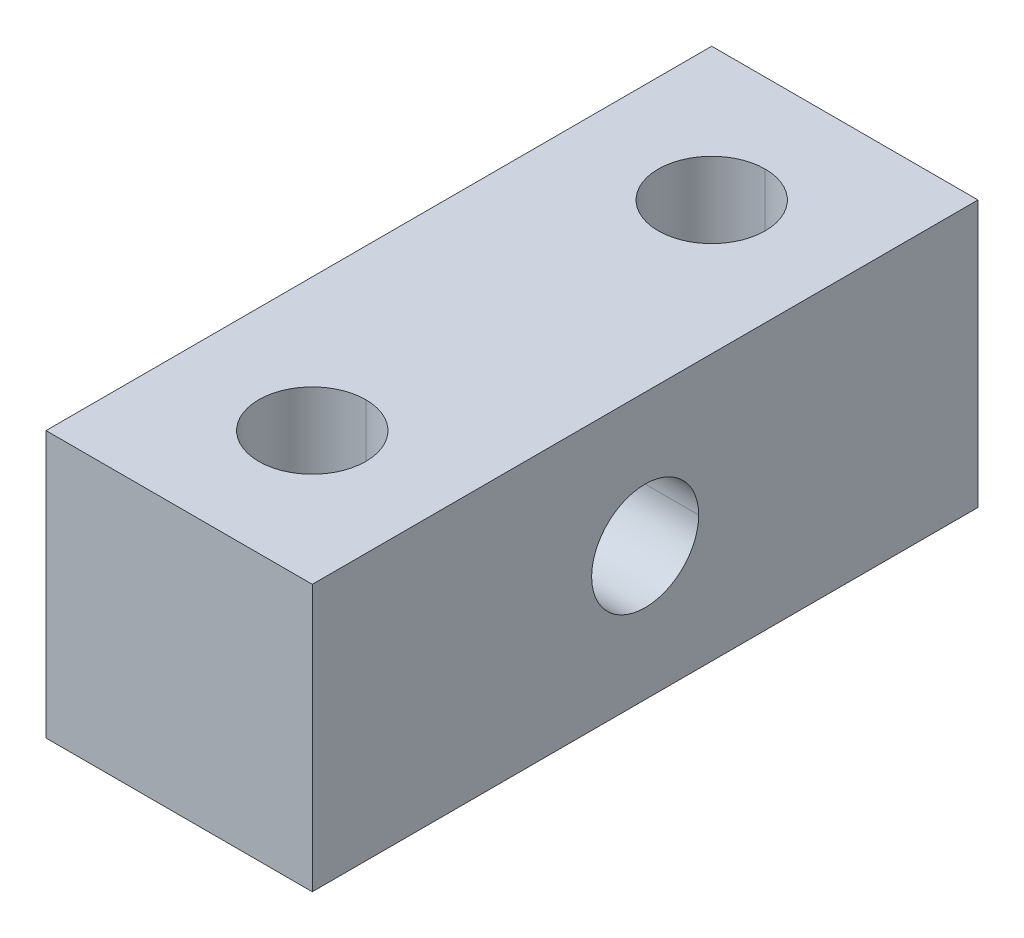
ISO-10303-21;
HEADER;
FILE_DESCRIPTION(('STEP AP214'),'2;1');
FILE_NAME('part.step','',(''),(''),'','','');
FILE_SCHEMA(('AUTOMOTIVE_DESIGN { 1 0 10303 214 1 1 1 1 }'));
ENDSEC;
DATA;
#1=APPLICATION_CONTEXT('core data for automotive mechanical design processes');
#2=APPLICATION_PROTOCOL_DEFINITION('international standard','automotive_design',2000,#1);
#3=PRODUCT_CONTEXT('',#1,'mechanical');
#4=PRODUCT('Part','Part','',(#3));
#5=PRODUCT_RELATED_PRODUCT_CATEGORY('part','',(#4));
#6=PRODUCT_DEFINITION_FORMATION('','',#4);
#7=PRODUCT_DEFINITION_CONTEXT('part definition',#1,'design');
#8=PRODUCT_DEFINITION('design','',#6,#7);
#9=PRODUCT_DEFINITION_SHAPE('','',#8);
#10=(LENGTH_UNIT() NAMED_UNIT(*) SI_UNIT(.MILLI.,.METRE.));
#11=(NAMED_UNIT(*) PLANE_ANGLE_UNIT() SI_UNIT($,.RADIAN.));
#12=(NAMED_UNIT(*) SI_UNIT($,.STERADIAN.) SOLID_ANGLE_UNIT());
#13=UNCERTAINTY_MEASURE_WITH_UNIT(LENGTH_MEASURE(1.E-05),#10,'distance_accuracy_value','');
#14=(GEOMETRIC_REPRESENTATION_CONTEXT(3) GLOBAL_UNCERTAINTY_ASSIGNED_CONTEXT((#13)) GLOBAL_UNIT_ASSIGNED_CONTEXT((#10,
#11,#12)) REPRESENTATION_CONTEXT('',''));
#15=CARTESIAN_POINT('',(0.,0.,0.));
#16=DIRECTION('',(0.,0.,1.));
#17=DIRECTION('',(1.,0.,0.));
#18=AXIS2_PLACEMENT_3D('',#15,#16,#17);
#19=CARTESIAN_POINT('',(6.35,0.,-15.875));
#20=DIRECTION('',(1.,0.,0.));
#21=DIRECTION('',(0.,0.,-1.));
#22=AXIS2_PLACEMENT_3D('',#19,#20,#21);
#23=CYLINDRICAL_SURFACE('',#22,2.5527);
#24=DIRECTION('',(1.,0.,0.));
#25=VECTOR('',#24,1.);
#26=CARTESIAN_POINT('',(6.35,0.,-13.3223));
#27=LINE('',#26,#25);
#28=CARTESIAN_POINT('',(-6.35,0.,-13.3223));
#29=VERTEX_POINT('',#28);
#30=CARTESIAN_POINT('',(6.35,0.,-13.3223));
#31=VERTEX_POINT('',#30);
#32=EDGE_CURVE('E153',#29,#31,#27,.T.);
#33=ORIENTED_EDGE('',*,*,#32,.F.);
#34=CARTESIAN_POINT('',(-6.35,0.,-15.875));
#35=DIRECTION('',(1.,0.,0.));
#36=DIRECTION('',(0.,0.,-1.));
#37=AXIS2_PLACEMENT_3D('',#34,#35,#36);
#38=CIRCLE('',#37,2.5527);
#39=CARTESIAN_POINT('',(-6.35,0.,-18.4277));
#40=VERTEX_POINT('',#39);
#41=EDGE_CURVE('E115',#40,#29,#38,.T.);
#42=ORIENTED_EDGE('',*,*,#41,.F.);
#43=DIRECTION('',(1.,0.,0.));
#44=VECTOR('',#43,1.);
#45=CARTESIAN_POINT('',(6.35,0.,-18.4277));
#46=LINE('',#45,#44);
#47=CARTESIAN_POINT('',(6.35,0.,-18.4277));
#48=VERTEX_POINT('',#47);
#49=EDGE_CURVE('E178',#40,#48,#46,.T.);
#50=ORIENTED_EDGE('',*,*,#49,.T.);
#51=CARTESIAN_POINT('',(6.35,0.,-15.875));
#52=DIRECTION('',(1.,0.,0.));
#53=DIRECTION('',(0.,0.,-1.));
#54=AXIS2_PLACEMENT_3D('',#51,#52,#53);
#55=CIRCLE('',#54,2.5527);
#56=EDGE_CURVE('E161',#48,#31,#55,.T.);
#57=ORIENTED_EDGE('',*,*,#56,.T.);
#58=EDGE_LOOP('',(#33,#42,#50,#57));
#59=FACE_BOUND('',#58,.T.);
#60=ADVANCED_FACE('F15',(#59),#23,.F.);
#61=CARTESIAN_POINT('',(0.,6.35,-6.35));
#62=DIRECTION('',(0.,1.,0.));
#63=DIRECTION('',(0.,0.,1.));
#64=AXIS2_PLACEMENT_3D('',#61,#62,#63);
#65=CYLINDRICAL_SURFACE('',#64,2.5527);
#66=DIRECTION('',(0.,1.,0.));
#67=VECTOR('',#66,1.);
#68=CARTESIAN_POINT('',(0.,6.35,-8.9027));
#69=LINE('',#68,#67);
#70=CARTESIAN_POINT('',(0.,-6.35,-8.9027));
#71=VERTEX_POINT('',#70);
#72=CARTESIAN_POINT('',(0.,6.35,-8.9027));
#73=VERTEX_POINT('',#72);
#74=EDGE_CURVE('E162',#71,#73,#69,.T.);
#75=ORIENTED_EDGE('',*,*,#74,.F.);
#76=CARTESIAN_POINT('',(0.,-6.35,-6.35));
#77=DIRECTION('',(0.,1.,0.));
#78=DIRECTION('',(0.,0.,1.));
#79=AXIS2_PLACEMENT_3D('',#76,#77,#78);
#80=CIRCLE('',#79,2.5527);
#81=CARTESIAN_POINT('',(0.,-6.35,-3.7973));
#82=VERTEX_POINT('',#81);
#83=EDGE_CURVE('E26',#82,#71,#80,.T.);
#84=ORIENTED_EDGE('',*,*,#83,.F.);
#85=DIRECTION('',(0.,1.,0.));
#86=VECTOR('',#85,1.);
#87=CARTESIAN_POINT('',(0.,6.35,-3.7973));
#88=LINE('',#87,#86);
#89=CARTESIAN_POINT('',(0.,6.35,-3.7973));
#90=VERTEX_POINT('',#89);
#91=EDGE_CURVE('E187',#82,#90,#88,.T.);
#92=ORIENTED_EDGE('',*,*,#91,.T.);
#93=CARTESIAN_POINT('',(0.,6.35,-6.35));
#94=DIRECTION('',(0.,1.,0.));
#95=DIRECTION('',(0.,0.,1.));
#96=AXIS2_PLACEMENT_3D('',#93,#94,#95);
#97=CIRCLE('',#96,2.5527);
#98=EDGE_CURVE('E201',#90,#73,#97,.T.);
#99=ORIENTED_EDGE('',*,*,#98,.T.);
#100=EDGE_LOOP('',(#75,#84,#92,#99));
#101=FACE_BOUND('',#100,.T.);
#102=ADVANCED_FACE('F223',(#101),#65,.F.);
#103=CARTESIAN_POINT('',(0.,6.35,-25.4));
#104=DIRECTION('',(0.,1.,0.));
#105=DIRECTION('',(0.,0.,1.));
#106=AXIS2_PLACEMENT_3D('',#103,#104,#105);
#107=CYLINDRICAL_SURFACE('',#106,2.5527);
#108=DIRECTION('',(0.,1.,0.));
#109=VECTOR('',#108,1.);
#110=CARTESIAN_POINT('',(0.,6.35,-27.9527));
#111=LINE('',#110,#109);
#112=CARTESIAN_POINT('',(0.,-6.35,-27.9527));
#113=VERTEX_POINT('',#112);
#114=CARTESIAN_POINT('',(0.,6.35,-27.9527));
#115=VERTEX_POINT('',#114);
#116=EDGE_CURVE('E19',#113,#115,#111,.T.);
#117=ORIENTED_EDGE('',*,*,#116,.F.);
#118=CARTESIAN_POINT('',(0.,-6.35,-25.4));
#119=DIRECTION('',(0.,1.,0.));
#120=DIRECTION('',(0.,0.,1.));
#121=AXIS2_PLACEMENT_3D('',#118,#119,#120);
#122=CIRCLE('',#121,2.5527);
#123=CARTESIAN_POINT('',(0.,-6.35,-22.8473));
#124=VERTEX_POINT('',#123);
#125=EDGE_CURVE('E10',#124,#113,#122,.T.);
#126=ORIENTED_EDGE('',*,*,#125,.F.);
#127=DIRECTION('',(0.,1.,0.));
#128=VECTOR('',#127,1.);
#129=CARTESIAN_POINT('',(0.,6.35,-22.8473));
#130=LINE('',#129,#128);
#131=CARTESIAN_POINT('',(0.,6.35,-22.8473));
#132=VERTEX_POINT('',#131);
#133=EDGE_CURVE('E132',#124,#132,#130,.T.);
#134=ORIENTED_EDGE('',*,*,#133,.T.);
#135=CARTESIAN_POINT('',(0.,6.35,-25.4));
#136=DIRECTION('',(0.,1.,0.));
#137=DIRECTION('',(0.,0.,1.));
#138=AXIS2_PLACEMENT_3D('',#135,#136,#137);
#139=CIRCLE('',#138,2.5527);
#140=EDGE_CURVE('E148',#132,#115,#139,.T.);
#141=ORIENTED_EDGE('',*,*,#140,.T.);
#142=EDGE_LOOP('',(#117,#126,#134,#141));
#143=FACE_BOUND('',#142,.T.);
#144=ADVANCED_FACE('F252',(#143),#107,.F.);
#145=CARTESIAN_POINT('',(-6.35,6.35,0.));
#146=DIRECTION('',(0.,0.,1.));
#147=DIRECTION('',(1.,0.,0.));
#148=AXIS2_PLACEMENT_3D('',#145,#146,#147);
#149=PLANE('',#148);
#150=DIRECTION('',(0.,-1.,0.));
#151=VECTOR('',#150,1.);
#152=CARTESIAN_POINT('',(-6.35,-6.35,0.));
#153=LINE('',#152,#151);
#154=CARTESIAN_POINT('',(-6.35,6.35,0.));
#155=VERTEX_POINT('',#154);
#156=CARTESIAN_POINT('',(-6.35,-6.35,0.));
#157=VERTEX_POINT('',#156);
#158=EDGE_CURVE('E107',#155,#157,#153,.T.);
#159=ORIENTED_EDGE('',*,*,#158,.T.);
#160=DIRECTION('',(1.,0.,0.));
#161=VECTOR('',#160,1.);
#162=CARTESIAN_POINT('',(6.35,-6.35,0.));
#163=LINE('',#162,#161);
#164=CARTESIAN_POINT('',(6.35,-6.35,0.));
#165=VERTEX_POINT('',#164);
#166=EDGE_CURVE('E156',#157,#165,#163,.T.);
#167=ORIENTED_EDGE('',*,*,#166,.T.);
#168=DIRECTION('',(0.,1.,0.));
#169=VECTOR('',#168,1.);
#170=CARTESIAN_POINT('',(6.35,-6.35,0.));
#171=LINE('',#170,#169);
#172=CARTESIAN_POINT('',(6.35,6.35,0.));
#173=VERTEX_POINT('',#172);
#174=EDGE_CURVE('E109',#165,#173,#171,.T.);
#175=ORIENTED_EDGE('',*,*,#174,.T.);
#176=DIRECTION('',(-1.,0.,0.));
#177=VECTOR('',#176,1.);
#178=CARTESIAN_POINT('',(6.35,6.35,0.));
#179=LINE('',#178,#177);
#180=EDGE_CURVE('E103',#173,#155,#179,.T.);
#181=ORIENTED_EDGE('',*,*,#180,.T.);
#182=EDGE_LOOP('',(#159,#167,#175,#181));
#183=FACE_BOUND('',#182,.T.);
#184=ADVANCED_FACE('F105',(#183),#149,.T.);
#185=CARTESIAN_POINT('',(-6.35,6.35,-31.75));
#186=DIRECTION('',(0.,0.,1.));
#187=DIRECTION('',(1.,0.,0.));
#188=AXIS2_PLACEMENT_3D('',#185,#186,#187);
#189=PLANE('',#188);
#190=DIRECTION('',(0.,-1.,0.));
#191=VECTOR('',#190,1.);
#192=CARTESIAN_POINT('',(-6.35,-6.35,-31.75));
#193=LINE('',#192,#191);
#194=CARTESIAN_POINT('',(-6.35,6.35,-31.75));
#195=VERTEX_POINT('',#194);
#196=CARTESIAN_POINT('',(-6.35,-6.35,-31.75));
#197=VERTEX_POINT('',#196);
#198=EDGE_CURVE('E127',#195,#197,#193,.T.);
#199=ORIENTED_EDGE('',*,*,#198,.F.);
#200=DIRECTION('',(-1.,0.,0.));
#201=VECTOR('',#200,1.);
#202=CARTESIAN_POINT('',(6.35,6.35,-31.75));
#203=LINE('',#202,#201);
#204=CARTESIAN_POINT('',(6.35,6.35,-31.75));
#205=VERTEX_POINT('',#204);
#206=EDGE_CURVE('E122',#205,#195,#203,.T.);
#207=ORIENTED_EDGE('',*,*,#206,.F.);
#208=DIRECTION('',(0.,1.,0.));
#209=VECTOR('',#208,1.);
#210=CARTESIAN_POINT('',(6.35,-6.35,-31.75));
#211=LINE('',#210,#209);
#212=CARTESIAN_POINT('',(6.35,-6.35,-31.75));
#213=VERTEX_POINT('',#212);
#214=EDGE_CURVE('E168',#213,#205,#211,.T.);
#215=ORIENTED_EDGE('',*,*,#214,.F.);
#216=DIRECTION('',(1.,0.,0.));
#217=VECTOR('',#216,1.);
#218=CARTESIAN_POINT('',(6.35,-6.35,-31.75));
#219=LINE('',#218,#217);
#220=EDGE_CURVE('E41',#197,#213,#219,.T.);
#221=ORIENTED_EDGE('',*,*,#220,.F.);
#222=EDGE_LOOP('',(#199,#207,#215,#221));
#223=FACE_BOUND('',#222,.T.);
#224=ADVANCED_FACE('F270',(#223),#189,.F.);
#225=CARTESIAN_POINT('',(6.35,-6.35,-31.75));
#226=DIRECTION('',(0.,-1.,0.));
#227=DIRECTION('',(0.,0.,-1.));
#228=AXIS2_PLACEMENT_3D('',#225,#226,#227);
#229=PLANE('',#228);
#230=ORIENTED_EDGE('',*,*,#125,.T.);
#231=CARTESIAN_POINT('',(0.,-6.35,-25.4));
#232=DIRECTION('',(0.,1.,0.));
#233=DIRECTION('',(0.,0.,1.));
#234=AXIS2_PLACEMENT_3D('',#231,#232,#233);
#235=CIRCLE('',#234,2.5527);
#236=EDGE_CURVE('E188',#113,#124,#235,.T.);
#237=ORIENTED_EDGE('',*,*,#236,.T.);
#238=EDGE_LOOP('',(#230,#237));
#239=FACE_BOUND('',#238,.T.);
#240=ORIENTED_EDGE('',*,*,#83,.T.);
#241=CARTESIAN_POINT('',(0.,-6.35,-6.35));
#242=DIRECTION('',(0.,1.,0.));
#243=DIRECTION('',(0.,0.,1.));
#244=AXIS2_PLACEMENT_3D('',#241,#242,#243);
#245=CIRCLE('',#244,2.5527);
#246=EDGE_CURVE('E143',#71,#82,#245,.T.);
#247=ORIENTED_EDGE('',*,*,#246,.T.);
#248=EDGE_LOOP('',(#240,#247));
#249=FACE_BOUND('',#248,.T.);
#250=ORIENTED_EDGE('',*,*,#166,.F.);
#251=DIRECTION('',(0.,0.,1.));
#252=VECTOR('',#251,1.);
#253=CARTESIAN_POINT('',(-6.35,-6.35,-31.75));
#254=LINE('',#253,#252);
#255=EDGE_CURVE('E130',#197,#157,#254,.T.);
#256=ORIENTED_EDGE('',*,*,#255,.F.);
#257=ORIENTED_EDGE('',*,*,#220,.T.);
#258=DIRECTION('',(0.,0.,1.));
#259=VECTOR('',#258,1.);
#260=CARTESIAN_POINT('',(6.35,-6.35,-31.75));
#261=LINE('',#260,#259);
#262=EDGE_CURVE('E147',#213,#165,#261,.T.);
#263=ORIENTED_EDGE('',*,*,#262,.T.);
#264=EDGE_LOOP('',(#250,#256,#257,#263));
#265=FACE_BOUND('',#264,.T.);
#266=ADVANCED_FACE('F242',(#239,#249,#265),#229,.T.);
#267=CARTESIAN_POINT('',(6.35,-6.35,-31.75));
#268=DIRECTION('',(1.,0.,0.));
#269=DIRECTION('',(0.,1.,0.));
#270=AXIS2_PLACEMENT_3D('',#267,#268,#269);
#271=PLANE('',#270);
#272=ORIENTED_EDGE('',*,*,#56,.F.);
#273=CARTESIAN_POINT('',(6.35,0.,-15.875));
#274=DIRECTION('',(1.,0.,0.));
#275=DIRECTION('',(0.,0.,-1.));
#276=AXIS2_PLACEMENT_3D('',#273,#274,#275);
#277=CIRCLE('',#276,2.5527);
#278=EDGE_CURVE('E174',#31,#48,#277,.T.);
#279=ORIENTED_EDGE('',*,*,#278,.F.);
#280=EDGE_LOOP('',(#272,#279));
#281=FACE_BOUND('',#280,.T.);
#282=ORIENTED_EDGE('',*,*,#174,.F.);
#283=ORIENTED_EDGE('',*,*,#262,.F.);
#284=ORIENTED_EDGE('',*,*,#214,.T.);
#285=DIRECTION('',(0.,0.,1.));
#286=VECTOR('',#285,1.);
#287=CARTESIAN_POINT('',(6.35,6.35,-31.75));
#288=LINE('',#287,#286);
#289=EDGE_CURVE('E114',#205,#173,#288,.T.);
#290=ORIENTED_EDGE('',*,*,#289,.T.);
#291=EDGE_LOOP('',(#282,#283,#284,#290));
#292=FACE_BOUND('',#291,.T.);
#293=ADVANCED_FACE('F232',(#281,#292),#271,.T.);
#294=CARTESIAN_POINT('',(6.35,6.35,-31.75));
#295=DIRECTION('',(0.,1.,0.));
#296=DIRECTION('',(1.,0.,0.));
#297=AXIS2_PLACEMENT_3D('',#294,#295,#296);
#298=PLANE('',#297);
#299=ORIENTED_EDGE('',*,*,#140,.F.);
#300=CARTESIAN_POINT('',(0.,6.35,-25.4));
#301=DIRECTION('',(0.,1.,0.));
#302=DIRECTION('',(0.,0.,1.));
#303=AXIS2_PLACEMENT_3D('',#300,#301,#302);
#304=CIRCLE('',#303,2.5527);
#305=EDGE_CURVE('E139',#115,#132,#304,.T.);
#306=ORIENTED_EDGE('',*,*,#305,.F.);
#307=EDGE_LOOP('',(#299,#306));
#308=FACE_BOUND('',#307,.T.);
#309=ORIENTED_EDGE('',*,*,#98,.F.);
#310=CARTESIAN_POINT('',(0.,6.35,-6.35));
#311=DIRECTION('',(0.,1.,0.));
#312=DIRECTION('',(0.,0.,1.));
#313=AXIS2_PLACEMENT_3D('',#310,#311,#312);
#314=CIRCLE('',#313,2.5527);
#315=EDGE_CURVE('E166',#73,#90,#314,.T.);
#316=ORIENTED_EDGE('',*,*,#315,.F.);
#317=EDGE_LOOP('',(#309,#316));
#318=FACE_BOUND('',#317,.T.);
#319=ORIENTED_EDGE('',*,*,#180,.F.);
#320=ORIENTED_EDGE('',*,*,#289,.F.);
#321=ORIENTED_EDGE('',*,*,#206,.T.);
#322=DIRECTION('',(0.,0.,1.));
#323=VECTOR('',#322,1.);
#324=CARTESIAN_POINT('',(-6.35,6.35,-31.75));
#325=LINE('',#324,#323);
#326=EDGE_CURVE('E119',#195,#155,#325,.T.);
#327=ORIENTED_EDGE('',*,*,#326,.T.);
#328=EDGE_LOOP('',(#319,#320,#321,#327));
#329=FACE_BOUND('',#328,.T.);
#330=ADVANCED_FACE('F120',(#308,#318,#329),#298,.T.);
#331=CARTESIAN_POINT('',(-6.35,-6.35,-31.75));
#332=DIRECTION('',(-1.,0.,0.));
#333=DIRECTION('',(0.,0.,1.));
#334=AXIS2_PLACEMENT_3D('',#331,#332,#333);
#335=PLANE('',#334);
#336=ORIENTED_EDGE('',*,*,#41,.T.);
#337=CARTESIAN_POINT('',(-6.35,0.,-15.875));
#338=DIRECTION('',(1.,0.,0.));
#339=DIRECTION('',(0.,0.,-1.));
#340=AXIS2_PLACEMENT_3D('',#337,#338,#339);
#341=CIRCLE('',#340,2.5527);
#342=EDGE_CURVE('E149',#29,#40,#341,.T.);
#343=ORIENTED_EDGE('',*,*,#342,.T.);
#344=EDGE_LOOP('',(#336,#343));
#345=FACE_BOUND('',#344,.T.);
#346=ORIENTED_EDGE('',*,*,#158,.F.);
#347=ORIENTED_EDGE('',*,*,#326,.F.);
#348=ORIENTED_EDGE('',*,*,#198,.T.);
#349=ORIENTED_EDGE('',*,*,#255,.T.);
#350=EDGE_LOOP('',(#346,#347,#348,#349));
#351=FACE_BOUND('',#350,.T.);
#352=ADVANCED_FACE('F17',(#345,#351),#335,.T.);
#353=CARTESIAN_POINT('',(0.,6.35,-25.4));
#354=DIRECTION('',(0.,1.,0.));
#355=DIRECTION('',(0.,0.,1.));
#356=AXIS2_PLACEMENT_3D('',#353,#354,#355);
#357=CYLINDRICAL_SURFACE('',#356,2.5527);
#358=ORIENTED_EDGE('',*,*,#236,.F.);
#359=ORIENTED_EDGE('',*,*,#116,.T.);
#360=ORIENTED_EDGE('',*,*,#305,.T.);
#361=ORIENTED_EDGE('',*,*,#133,.F.);
#362=EDGE_LOOP('',(#358,#359,#360,#361));
#363=FACE_BOUND('',#362,.T.);
#364=ADVANCED_FACE('F240',(#363),#357,.F.);
#365=CARTESIAN_POINT('',(0.,6.35,-6.35));
#366=DIRECTION('',(0.,1.,0.));
#367=DIRECTION('',(0.,0.,1.));
#368=AXIS2_PLACEMENT_3D('',#365,#366,#367);
#369=CYLINDRICAL_SURFACE('',#368,2.5527);
#370=ORIENTED_EDGE('',*,*,#246,.F.);
#371=ORIENTED_EDGE('',*,*,#74,.T.);
#372=ORIENTED_EDGE('',*,*,#315,.T.);
#373=ORIENTED_EDGE('',*,*,#91,.F.);
#374=EDGE_LOOP('',(#370,#371,#372,#373));
#375=FACE_BOUND('',#374,.T.);
#376=ADVANCED_FACE('F229',(#375),#369,.F.);
#377=CARTESIAN_POINT('',(6.35,0.,-15.875));
#378=DIRECTION('',(1.,0.,0.));
#379=DIRECTION('',(0.,0.,-1.));
#380=AXIS2_PLACEMENT_3D('',#377,#378,#379);
#381=CYLINDRICAL_SURFACE('',#380,2.5527);
#382=ORIENTED_EDGE('',*,*,#342,.F.);
#383=ORIENTED_EDGE('',*,*,#32,.T.);
#384=ORIENTED_EDGE('',*,*,#278,.T.);
#385=ORIENTED_EDGE('',*,*,#49,.F.);
#386=EDGE_LOOP('',(#382,#383,#384,#385));
#387=FACE_BOUND('',#386,.T.);
#388=ADVANCED_FACE('F256',(#387),#381,.F.);
#389=CLOSED_SHELL('',(#60,#102,#144,#184,#224,#266,#293,#330,#352,#364,#376,#388));
#390=MANIFOLD_SOLID_BREP('B1',#389);
#391=ADVANCED_BREP_SHAPE_REPRESENTATION('',(#18,#390),#14);
#392=SHAPE_DEFINITION_REPRESENTATION(#9,#391);
ENDSEC;
END-ISO-10303-21;
